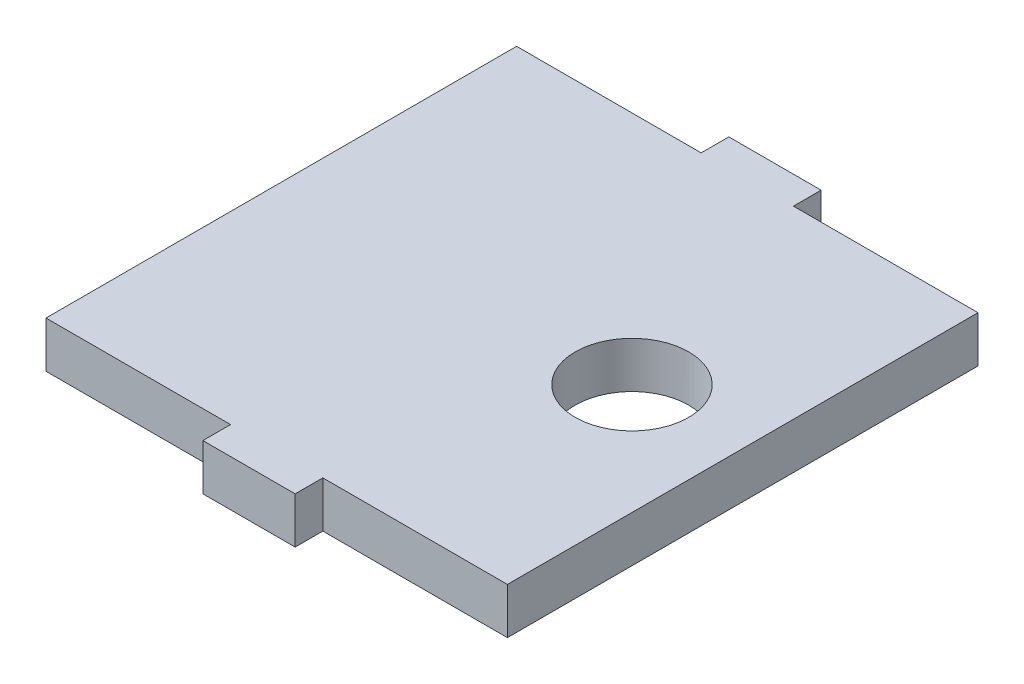
ISO-10303-21;
HEADER;
FILE_DESCRIPTION(('STEP AP214'),'2;1');
FILE_NAME('part.step','',(''),(''),'','','');
FILE_SCHEMA(('AUTOMOTIVE_DESIGN { 1 0 10303 214 1 1 1 1 }'));
ENDSEC;
DATA;
#1=APPLICATION_CONTEXT('core data for automotive mechanical design processes');
#2=APPLICATION_PROTOCOL_DEFINITION('international standard','automotive_design',2000,#1);
#3=PRODUCT_CONTEXT('',#1,'mechanical');
#4=PRODUCT('Part','Part','',(#3));
#5=PRODUCT_RELATED_PRODUCT_CATEGORY('part','',(#4));
#6=PRODUCT_DEFINITION_FORMATION('','',#4);
#7=PRODUCT_DEFINITION_CONTEXT('part definition',#1,'design');
#8=PRODUCT_DEFINITION('design','',#6,#7);
#9=PRODUCT_DEFINITION_SHAPE('','',#8);
#10=(LENGTH_UNIT() NAMED_UNIT(*) SI_UNIT(.MILLI.,.METRE.));
#11=(NAMED_UNIT(*) PLANE_ANGLE_UNIT() SI_UNIT($,.RADIAN.));
#12=(NAMED_UNIT(*) SI_UNIT($,.STERADIAN.) SOLID_ANGLE_UNIT());
#13=UNCERTAINTY_MEASURE_WITH_UNIT(LENGTH_MEASURE(1.E-05),#10,'distance_accuracy_value','');
#14=(GEOMETRIC_REPRESENTATION_CONTEXT(3) GLOBAL_UNCERTAINTY_ASSIGNED_CONTEXT((#13)) GLOBAL_UNIT_ASSIGNED_CONTEXT((#10,
#11,#12)) REPRESENTATION_CONTEXT('',''));
#15=CARTESIAN_POINT('',(0.,0.,0.));
#16=DIRECTION('',(0.,0.,1.));
#17=DIRECTION('',(1.,0.,0.));
#18=AXIS2_PLACEMENT_3D('',#15,#16,#17);
#19=CARTESIAN_POINT('',(0.,0.,56.));
#20=DIRECTION('',(0.,0.,1.));
#21=DIRECTION('',(1.,0.,0.));
#22=AXIS2_PLACEMENT_3D('',#19,#20,#21);
#23=PLANE('',#22);
#24=DIRECTION('',(-1.,0.,0.));
#25=VECTOR('',#24,1.);
#26=CARTESIAN_POINT('',(0.,0.5,56.));
#27=LINE('',#26,#25);
#28=CARTESIAN_POINT('',(11.,0.499999999999997,56.));
#29=VERTEX_POINT('',#28);
#30=CARTESIAN_POINT('',(-9.,0.499999999999999,56.));
#31=VERTEX_POINT('',#30);
#32=EDGE_CURVE('E129',#29,#31,#27,.T.);
#33=ORIENTED_EDGE('',*,*,#32,.F.);
#34=DIRECTION('',(0.,1.,0.));
#35=VECTOR('',#34,1.);
#36=CARTESIAN_POINT('',(11.,-9.94030650891056,56.));
#37=LINE('',#36,#35);
#38=CARTESIAN_POINT('',(11.,5.5,56.));
#39=VERTEX_POINT('',#38);
#40=EDGE_CURVE('E135',#29,#39,#37,.T.);
#41=ORIENTED_EDGE('',*,*,#40,.T.);
#42=DIRECTION('',(-1.,0.,0.));
#43=VECTOR('',#42,1.);
#44=CARTESIAN_POINT('',(0.,5.5,56.));
#45=LINE('',#44,#43);
#46=CARTESIAN_POINT('',(-9.,5.5,56.));
#47=VERTEX_POINT('',#46);
#48=EDGE_CURVE('E159',#39,#47,#45,.T.);
#49=ORIENTED_EDGE('',*,*,#48,.T.);
#50=DIRECTION('',(0.,-1.,0.));
#51=VECTOR('',#50,1.);
#52=CARTESIAN_POINT('',(-9.,0.,56.));
#53=LINE('',#52,#51);
#54=EDGE_CURVE('E143',#47,#31,#53,.T.);
#55=ORIENTED_EDGE('',*,*,#54,.T.);
#56=EDGE_LOOP('',(#33,#41,#49,#55));
#57=FACE_BOUND('',#56,.T.);
#58=ADVANCED_FACE('F36',(#57),#23,.T.);
#59=CARTESIAN_POINT('',(0.,0.,5.));
#60=DIRECTION('',(0.,0.,1.));
#61=DIRECTION('',(1.,0.,0.));
#62=AXIS2_PLACEMENT_3D('',#59,#60,#61);
#63=PLANE('',#62);
#64=DIRECTION('',(0.,1.,0.));
#65=VECTOR('',#64,1.);
#66=CARTESIAN_POINT('',(11.,-9.94030650891056,5.));
#67=LINE('',#66,#65);
#68=CARTESIAN_POINT('',(11.,0.499999999999999,5.));
#69=VERTEX_POINT('',#68);
#70=CARTESIAN_POINT('',(11.,5.5,5.));
#71=VERTEX_POINT('',#70);
#72=EDGE_CURVE('E198',#69,#71,#67,.T.);
#73=ORIENTED_EDGE('',*,*,#72,.F.);
#74=DIRECTION('',(-1.,0.,0.));
#75=VECTOR('',#74,1.);
#76=CARTESIAN_POINT('',(0.,0.5,5.));
#77=LINE('',#76,#75);
#78=CARTESIAN_POINT('',(-9.,0.499999999999999,5.));
#79=VERTEX_POINT('',#78);
#80=EDGE_CURVE('E169',#69,#79,#77,.T.);
#81=ORIENTED_EDGE('',*,*,#80,.T.);
#82=DIRECTION('',(0.,-1.,0.));
#83=VECTOR('',#82,1.);
#84=CARTESIAN_POINT('',(-9.,0.,5.));
#85=LINE('',#84,#83);
#86=CARTESIAN_POINT('',(-9.,5.5,5.));
#87=VERTEX_POINT('',#86);
#88=EDGE_CURVE('E146',#87,#79,#85,.T.);
#89=ORIENTED_EDGE('',*,*,#88,.F.);
#90=DIRECTION('',(-1.,0.,0.));
#91=VECTOR('',#90,1.);
#92=CARTESIAN_POINT('',(0.,5.5,5.));
#93=LINE('',#92,#91);
#94=EDGE_CURVE('E172',#71,#87,#93,.T.);
#95=ORIENTED_EDGE('',*,*,#94,.F.);
#96=EDGE_LOOP('',(#73,#81,#89,#95));
#97=FACE_BOUND('',#96,.T.);
#98=ADVANCED_FACE('F250',(#97),#63,.F.);
#99=CARTESIAN_POINT('',(0.,0.5,56.));
#100=DIRECTION('',(0.,-1.,0.));
#101=DIRECTION('',(1.,0.,0.));
#102=AXIS2_PLACEMENT_3D('',#99,#100,#101);
#103=PLANE('',#102);
#104=CARTESIAN_POINT('',(29.,0.5,30.5));
#105=DIRECTION('',(0.,-1.,0.));
#106=DIRECTION('',(1.,0.,0.));
#107=AXIS2_PLACEMENT_3D('',#104,#105,#106);
#108=CIRCLE('',#107,6.15);
#109=CARTESIAN_POINT('',(35.15,0.500000000000001,30.5));
#110=VERTEX_POINT('',#109);
#111=EDGE_CURVE('E231',#110,#110,#108,.F.);
#112=ORIENTED_EDGE('',*,*,#111,.T.);
#113=EDGE_LOOP('',(#112));
#114=FACE_BOUND('',#113,.T.);
#115=CARTESIAN_POINT('',(41.,0.500000000000002,5.));
#116=VERTEX_POINT('',#115);
#117=CARTESIAN_POINT('',(21.,0.5,4.99999999999999));
#118=VERTEX_POINT('',#117);
#119=EDGE_CURVE('E165',#116,#118,#77,.T.);
#120=ORIENTED_EDGE('',*,*,#119,.F.);
#121=DIRECTION('',(0.,0.,-1.));
#122=VECTOR('',#121,1.);
#123=CARTESIAN_POINT('',(41.,0.500000000000002,56.));
#124=LINE('',#123,#122);
#125=CARTESIAN_POINT('',(41.,0.500000000000002,56.));
#126=VERTEX_POINT('',#125);
#127=EDGE_CURVE('E11',#126,#116,#124,.T.);
#128=ORIENTED_EDGE('',*,*,#127,.F.);
#129=CARTESIAN_POINT('',(21.,0.5,56.));
#130=VERTEX_POINT('',#129);
#131=EDGE_CURVE('E145',#126,#130,#27,.T.);
#132=ORIENTED_EDGE('',*,*,#131,.T.);
#133=DIRECTION('',(0.,0.,-1.));
#134=VECTOR('',#133,1.);
#135=CARTESIAN_POINT('',(21.,0.5,56.));
#136=LINE('',#135,#134);
#137=CARTESIAN_POINT('',(21.,0.5,59.));
#138=VERTEX_POINT('',#137);
#139=EDGE_CURVE('E218',#138,#130,#136,.T.);
#140=ORIENTED_EDGE('',*,*,#139,.F.);
#141=DIRECTION('',(1.,0.,0.));
#142=VECTOR('',#141,1.);
#143=CARTESIAN_POINT('',(21.,0.5,59.));
#144=LINE('',#143,#142);
#145=CARTESIAN_POINT('',(11.,0.499999999999999,59.));
#146=VERTEX_POINT('',#145);
#147=EDGE_CURVE('E132',#146,#138,#144,.T.);
#148=ORIENTED_EDGE('',*,*,#147,.F.);
#149=DIRECTION('',(0.,0.,1.));
#150=VECTOR('',#149,1.);
#151=CARTESIAN_POINT('',(11.,0.499999999999999,56.));
#152=LINE('',#151,#150);
#153=EDGE_CURVE('E125',#29,#146,#152,.T.);
#154=ORIENTED_EDGE('',*,*,#153,.F.);
#155=ORIENTED_EDGE('',*,*,#32,.T.);
#156=DIRECTION('',(0.,0.,-1.));
#157=VECTOR('',#156,1.);
#158=CARTESIAN_POINT('',(-9.,0.499999999999999,56.));
#159=LINE('',#158,#157);
#160=EDGE_CURVE('E164',#31,#79,#159,.T.);
#161=ORIENTED_EDGE('',*,*,#160,.T.);
#162=ORIENTED_EDGE('',*,*,#80,.F.);
#163=DIRECTION('',(0.,0.,1.));
#164=VECTOR('',#163,1.);
#165=CARTESIAN_POINT('',(11.,0.499999999999999,5.));
#166=LINE('',#165,#164);
#167=CARTESIAN_POINT('',(11.,0.499999999999997,2.));
#168=VERTEX_POINT('',#167);
#169=EDGE_CURVE('E200',#168,#69,#166,.T.);
#170=ORIENTED_EDGE('',*,*,#169,.F.);
#171=DIRECTION('',(-1.,0.,0.));
#172=VECTOR('',#171,1.);
#173=CARTESIAN_POINT('',(21.,0.5,1.99999999999999));
#174=LINE('',#173,#172);
#175=CARTESIAN_POINT('',(21.,0.5,1.99999999999999));
#176=VERTEX_POINT('',#175);
#177=EDGE_CURVE('E194',#176,#168,#174,.T.);
#178=ORIENTED_EDGE('',*,*,#177,.F.);
#179=DIRECTION('',(0.,0.,-1.));
#180=VECTOR('',#179,1.);
#181=CARTESIAN_POINT('',(21.,0.5,4.99999999999999));
#182=LINE('',#181,#180);
#183=EDGE_CURVE('E192',#118,#176,#182,.T.);
#184=ORIENTED_EDGE('',*,*,#183,.F.);
#185=EDGE_LOOP('',(#120,#128,#132,#140,#148,#154,#155,#161,#162,#170,#178,#184));
#186=FACE_BOUND('',#185,.T.);
#187=ADVANCED_FACE('F38',(#114,#186),#103,.T.);
#188=CARTESIAN_POINT('',(41.,0.,56.));
#189=DIRECTION('',(1.,0.,0.));
#190=DIRECTION('',(0.,0.,-1.));
#191=AXIS2_PLACEMENT_3D('',#188,#189,#190);
#192=PLANE('',#191);
#193=DIRECTION('',(0.,-1.,0.));
#194=VECTOR('',#193,1.);
#195=CARTESIAN_POINT('',(41.,0.,5.));
#196=LINE('',#195,#194);
#197=CARTESIAN_POINT('',(41.,5.5,5.));
#198=VERTEX_POINT('',#197);
#199=EDGE_CURVE('E168',#198,#116,#196,.T.);
#200=ORIENTED_EDGE('',*,*,#199,.F.);
#201=DIRECTION('',(0.,0.,-1.));
#202=VECTOR('',#201,1.);
#203=CARTESIAN_POINT('',(41.,5.5,56.));
#204=LINE('',#203,#202);
#205=CARTESIAN_POINT('',(41.,5.5,56.));
#206=VERTEX_POINT('',#205);
#207=EDGE_CURVE('E44',#206,#198,#204,.T.);
#208=ORIENTED_EDGE('',*,*,#207,.F.);
#209=DIRECTION('',(0.,-1.,0.));
#210=VECTOR('',#209,1.);
#211=CARTESIAN_POINT('',(41.,0.,56.));
#212=LINE('',#211,#210);
#213=EDGE_CURVE('E149',#206,#126,#212,.T.);
#214=ORIENTED_EDGE('',*,*,#213,.T.);
#215=ORIENTED_EDGE('',*,*,#127,.T.);
#216=EDGE_LOOP('',(#200,#208,#214,#215));
#217=FACE_BOUND('',#216,.T.);
#218=ADVANCED_FACE('F189',(#217),#192,.T.);
#219=CARTESIAN_POINT('',(0.,5.5,56.));
#220=DIRECTION('',(0.,-1.,0.));
#221=DIRECTION('',(1.,0.,0.));
#222=AXIS2_PLACEMENT_3D('',#219,#220,#221);
#223=PLANE('',#222);
#224=CARTESIAN_POINT('',(29.,5.5,30.5));
#225=DIRECTION('',(0.,1.,0.));
#226=DIRECTION('',(-1.,0.,0.));
#227=AXIS2_PLACEMENT_3D('',#224,#225,#226);
#228=CIRCLE('',#227,6.15);
#229=CARTESIAN_POINT('',(22.85,5.5,30.5));
#230=VERTEX_POINT('',#229);
#231=EDGE_CURVE('E227',#230,#230,#228,.T.);
#232=ORIENTED_EDGE('',*,*,#231,.F.);
#233=EDGE_LOOP('',(#232));
#234=FACE_BOUND('',#233,.T.);
#235=CARTESIAN_POINT('',(21.,5.5,5.));
#236=VERTEX_POINT('',#235);
#237=EDGE_CURVE('E151',#198,#236,#93,.T.);
#238=ORIENTED_EDGE('',*,*,#237,.T.);
#239=DIRECTION('',(0.,0.,-1.));
#240=VECTOR('',#239,1.);
#241=CARTESIAN_POINT('',(21.,5.5,4.99999999999999));
#242=LINE('',#241,#240);
#243=CARTESIAN_POINT('',(21.,5.5,1.99999999999999));
#244=VERTEX_POINT('',#243);
#245=EDGE_CURVE('E59',#236,#244,#242,.T.);
#246=ORIENTED_EDGE('',*,*,#245,.T.);
#247=DIRECTION('',(-1.,0.,0.));
#248=VECTOR('',#247,1.);
#249=CARTESIAN_POINT('',(21.,5.5,1.99999999999999));
#250=LINE('',#249,#248);
#251=CARTESIAN_POINT('',(11.,5.5,2.));
#252=VERTEX_POINT('',#251);
#253=EDGE_CURVE('E211',#244,#252,#250,.T.);
#254=ORIENTED_EDGE('',*,*,#253,.T.);
#255=DIRECTION('',(0.,0.,1.));
#256=VECTOR('',#255,1.);
#257=CARTESIAN_POINT('',(11.,5.5,5.));
#258=LINE('',#257,#256);
#259=EDGE_CURVE('E208',#252,#71,#258,.T.);
#260=ORIENTED_EDGE('',*,*,#259,.T.);
#261=ORIENTED_EDGE('',*,*,#94,.T.);
#262=DIRECTION('',(0.,0.,-1.));
#263=VECTOR('',#262,1.);
#264=CARTESIAN_POINT('',(-9.,5.5,56.));
#265=LINE('',#264,#263);
#266=EDGE_CURVE('E176',#47,#87,#265,.T.);
#267=ORIENTED_EDGE('',*,*,#266,.F.);
#268=ORIENTED_EDGE('',*,*,#48,.F.);
#269=DIRECTION('',(0.,0.,1.));
#270=VECTOR('',#269,1.);
#271=CARTESIAN_POINT('',(11.,5.5,56.));
#272=LINE('',#271,#270);
#273=CARTESIAN_POINT('',(11.,5.5,59.));
#274=VERTEX_POINT('',#273);
#275=EDGE_CURVE('E51',#39,#274,#272,.T.);
#276=ORIENTED_EDGE('',*,*,#275,.T.);
#277=DIRECTION('',(1.,0.,0.));
#278=VECTOR('',#277,1.);
#279=CARTESIAN_POINT('',(21.,5.5,59.));
#280=LINE('',#279,#278);
#281=CARTESIAN_POINT('',(21.,5.5,59.));
#282=VERTEX_POINT('',#281);
#283=EDGE_CURVE('E140',#274,#282,#280,.T.);
#284=ORIENTED_EDGE('',*,*,#283,.T.);
#285=DIRECTION('',(0.,0.,-1.));
#286=VECTOR('',#285,1.);
#287=CARTESIAN_POINT('',(21.,5.5,56.));
#288=LINE('',#287,#286);
#289=CARTESIAN_POINT('',(21.,5.5,56.));
#290=VERTEX_POINT('',#289);
#291=EDGE_CURVE('E225',#282,#290,#288,.T.);
#292=ORIENTED_EDGE('',*,*,#291,.T.);
#293=EDGE_CURVE('E160',#206,#290,#45,.T.);
#294=ORIENTED_EDGE('',*,*,#293,.F.);
#295=ORIENTED_EDGE('',*,*,#207,.T.);
#296=EDGE_LOOP('',(#238,#246,#254,#260,#261,#267,#268,#276,#284,#292,#294,#295));
#297=FACE_BOUND('',#296,.T.);
#298=ADVANCED_FACE('F181',(#234,#297),#223,.F.);
#299=CARTESIAN_POINT('',(-9.,0.,56.));
#300=DIRECTION('',(1.,0.,0.));
#301=DIRECTION('',(0.,0.,-1.));
#302=AXIS2_PLACEMENT_3D('',#299,#300,#301);
#303=PLANE('',#302);
#304=ORIENTED_EDGE('',*,*,#88,.T.);
#305=ORIENTED_EDGE('',*,*,#160,.F.);
#306=ORIENTED_EDGE('',*,*,#54,.F.);
#307=ORIENTED_EDGE('',*,*,#266,.T.);
#308=EDGE_LOOP('',(#304,#305,#306,#307));
#309=FACE_BOUND('',#308,.T.);
#310=ADVANCED_FACE('F240',(#309),#303,.F.);
#311=DIRECTION('',(0.,1.,0.));
#312=VECTOR('',#311,1.);
#313=CARTESIAN_POINT('',(21.,-9.94030650891056,56.));
#314=LINE('',#313,#312);
#315=EDGE_CURVE('E215',#130,#290,#314,.T.);
#316=ORIENTED_EDGE('',*,*,#315,.F.);
#317=ORIENTED_EDGE('',*,*,#131,.F.);
#318=ORIENTED_EDGE('',*,*,#213,.F.);
#319=ORIENTED_EDGE('',*,*,#293,.T.);
#320=EDGE_LOOP('',(#316,#317,#318,#319));
#321=FACE_BOUND('',#320,.T.);
#322=ADVANCED_FACE('F246',(#321),#23,.T.);
#323=ORIENTED_EDGE('',*,*,#119,.T.);
#324=DIRECTION('',(0.,1.,0.));
#325=VECTOR('',#324,1.);
#326=CARTESIAN_POINT('',(21.,-9.94030650891056,4.99999999999999));
#327=LINE('',#326,#325);
#328=EDGE_CURVE('E188',#118,#236,#327,.T.);
#329=ORIENTED_EDGE('',*,*,#328,.T.);
#330=ORIENTED_EDGE('',*,*,#237,.F.);
#331=ORIENTED_EDGE('',*,*,#199,.T.);
#332=EDGE_LOOP('',(#323,#329,#330,#331));
#333=FACE_BOUND('',#332,.T.);
#334=ADVANCED_FACE('F187',(#333),#63,.F.);
#335=CARTESIAN_POINT('',(21.,-9.94030650891056,1.99999999999999));
#336=DIRECTION('',(0.,0.,-1.));
#337=DIRECTION('',(-1.,0.,0.));
#338=AXIS2_PLACEMENT_3D('',#335,#336,#337);
#339=PLANE('',#338);
#340=DIRECTION('',(0.,1.,0.));
#341=VECTOR('',#340,1.);
#342=CARTESIAN_POINT('',(21.,-9.94030650891056,1.99999999999999));
#343=LINE('',#342,#341);
#344=EDGE_CURVE('E155',#176,#244,#343,.T.);
#345=ORIENTED_EDGE('',*,*,#344,.F.);
#346=ORIENTED_EDGE('',*,*,#177,.T.);
#347=DIRECTION('',(0.,1.,0.));
#348=VECTOR('',#347,1.);
#349=CARTESIAN_POINT('',(11.,-9.94030650891056,2.));
#350=LINE('',#349,#348);
#351=EDGE_CURVE('E203',#168,#252,#350,.T.);
#352=ORIENTED_EDGE('',*,*,#351,.T.);
#353=ORIENTED_EDGE('',*,*,#253,.F.);
#354=EDGE_LOOP('',(#345,#346,#352,#353));
#355=FACE_BOUND('',#354,.T.);
#356=ADVANCED_FACE('F263',(#355),#339,.T.);
#357=CARTESIAN_POINT('',(11.,-9.94030650891056,5.));
#358=DIRECTION('',(-1.,0.,0.));
#359=DIRECTION('',(0.,0.,1.));
#360=AXIS2_PLACEMENT_3D('',#357,#358,#359);
#361=PLANE('',#360);
#362=ORIENTED_EDGE('',*,*,#351,.F.);
#363=ORIENTED_EDGE('',*,*,#169,.T.);
#364=ORIENTED_EDGE('',*,*,#72,.T.);
#365=ORIENTED_EDGE('',*,*,#259,.F.);
#366=EDGE_LOOP('',(#362,#363,#364,#365));
#367=FACE_BOUND('',#366,.T.);
#368=ADVANCED_FACE('F278',(#367),#361,.T.);
#369=CARTESIAN_POINT('',(21.,-9.94030650891056,4.99999999999999));
#370=DIRECTION('',(1.,0.,0.));
#371=DIRECTION('',(0.,1.,0.));
#372=AXIS2_PLACEMENT_3D('',#369,#370,#371);
#373=PLANE('',#372);
#374=ORIENTED_EDGE('',*,*,#328,.F.);
#375=ORIENTED_EDGE('',*,*,#183,.T.);
#376=ORIENTED_EDGE('',*,*,#344,.T.);
#377=ORIENTED_EDGE('',*,*,#245,.F.);
#378=EDGE_LOOP('',(#374,#375,#376,#377));
#379=FACE_BOUND('',#378,.T.);
#380=ADVANCED_FACE('F197',(#379),#373,.T.);
#381=CARTESIAN_POINT('',(11.,-9.94030650891056,56.));
#382=DIRECTION('',(-1.,0.,0.));
#383=DIRECTION('',(0.,0.,1.));
#384=AXIS2_PLACEMENT_3D('',#381,#382,#383);
#385=PLANE('',#384);
#386=ORIENTED_EDGE('',*,*,#40,.F.);
#387=ORIENTED_EDGE('',*,*,#153,.T.);
#388=DIRECTION('',(0.,1.,0.));
#389=VECTOR('',#388,1.);
#390=CARTESIAN_POINT('',(11.,-9.94030650891056,59.));
#391=LINE('',#390,#389);
#392=EDGE_CURVE('E134',#146,#274,#391,.T.);
#393=ORIENTED_EDGE('',*,*,#392,.T.);
#394=ORIENTED_EDGE('',*,*,#275,.F.);
#395=EDGE_LOOP('',(#386,#387,#393,#394));
#396=FACE_BOUND('',#395,.T.);
#397=ADVANCED_FACE('F137',(#396),#385,.T.);
#398=CARTESIAN_POINT('',(21.,-9.94030650891056,59.));
#399=DIRECTION('',(0.,0.,1.));
#400=DIRECTION('',(1.,0.,0.));
#401=AXIS2_PLACEMENT_3D('',#398,#399,#400);
#402=PLANE('',#401);
#403=ORIENTED_EDGE('',*,*,#392,.F.);
#404=ORIENTED_EDGE('',*,*,#147,.T.);
#405=DIRECTION('',(0.,1.,0.));
#406=VECTOR('',#405,1.);
#407=CARTESIAN_POINT('',(21.,-9.94030650891056,59.));
#408=LINE('',#407,#406);
#409=EDGE_CURVE('E221',#138,#282,#408,.T.);
#410=ORIENTED_EDGE('',*,*,#409,.T.);
#411=ORIENTED_EDGE('',*,*,#283,.F.);
#412=EDGE_LOOP('',(#403,#404,#410,#411));
#413=FACE_BOUND('',#412,.T.);
#414=ADVANCED_FACE('F271',(#413),#402,.T.);
#415=CARTESIAN_POINT('',(21.,-9.94030650891056,56.));
#416=DIRECTION('',(1.,0.,0.));
#417=DIRECTION('',(0.,1.,0.));
#418=AXIS2_PLACEMENT_3D('',#415,#416,#417);
#419=PLANE('',#418);
#420=ORIENTED_EDGE('',*,*,#409,.F.);
#421=ORIENTED_EDGE('',*,*,#139,.T.);
#422=ORIENTED_EDGE('',*,*,#315,.T.);
#423=ORIENTED_EDGE('',*,*,#291,.F.);
#424=EDGE_LOOP('',(#420,#421,#422,#423));
#425=FACE_BOUND('',#424,.T.);
#426=ADVANCED_FACE('F268',(#425),#419,.T.);
#427=CARTESIAN_POINT('',(29.,-74.001,30.5));
#428=DIRECTION('',(0.,1.,0.));
#429=DIRECTION('',(-1.,0.,0.));
#430=AXIS2_PLACEMENT_3D('',#427,#428,#429);
#431=CYLINDRICAL_SURFACE('',#430,6.15);
#432=ORIENTED_EDGE('',*,*,#111,.F.);
#433=EDGE_LOOP('',(#432));
#434=FACE_BOUND('',#433,.T.);
#435=ORIENTED_EDGE('',*,*,#231,.T.);
#436=EDGE_LOOP('',(#435));
#437=FACE_BOUND('',#436,.T.);
#438=ADVANCED_FACE('F237',(#434,#437),#431,.F.);
#439=CLOSED_SHELL('',(#58,#98,#187,#218,#298,#310,#322,#334,#356,#368,#380,#397,#414,#426,#438));
#440=MANIFOLD_SOLID_BREP('B2',#439);
#441=ADVANCED_BREP_SHAPE_REPRESENTATION('',(#18,#440),#14);
#442=SHAPE_DEFINITION_REPRESENTATION(#9,#441);
ENDSEC;
END-ISO-10303-21;
